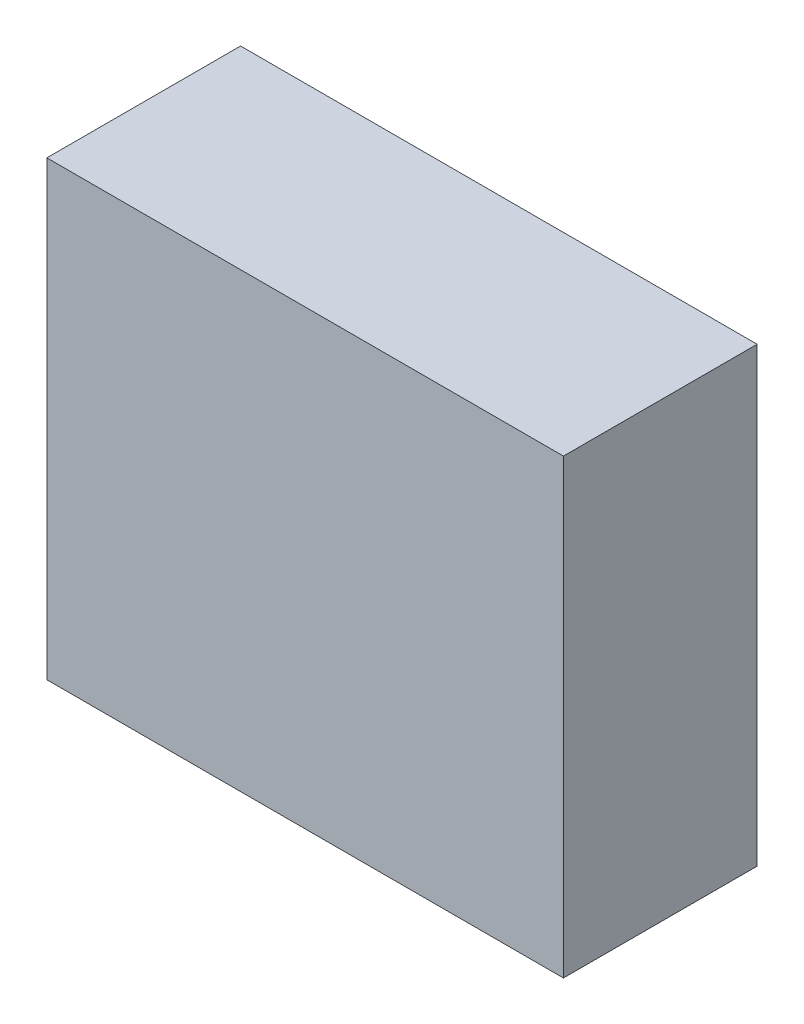
ISO-10303-21;
HEADER;
FILE_DESCRIPTION(('STEP AP214'),'2;1');
FILE_NAME('part.step','',(''),(''),'','','');
FILE_SCHEMA(('AUTOMOTIVE_DESIGN { 1 0 10303 214 1 1 1 1 }'));
ENDSEC;
DATA;
#1=APPLICATION_CONTEXT('core data for automotive mechanical design processes');
#2=APPLICATION_PROTOCOL_DEFINITION('international standard','automotive_design',2000,#1);
#3=PRODUCT_CONTEXT('',#1,'mechanical');
#4=PRODUCT('Part','Part','',(#3));
#5=PRODUCT_RELATED_PRODUCT_CATEGORY('part','',(#4));
#6=PRODUCT_DEFINITION_FORMATION('','',#4);
#7=PRODUCT_DEFINITION_CONTEXT('part definition',#1,'design');
#8=PRODUCT_DEFINITION('design','',#6,#7);
#9=PRODUCT_DEFINITION_SHAPE('','',#8);
#10=(LENGTH_UNIT() NAMED_UNIT(*) SI_UNIT(.MILLI.,.METRE.));
#11=(NAMED_UNIT(*) PLANE_ANGLE_UNIT() SI_UNIT($,.RADIAN.));
#12=(NAMED_UNIT(*) SI_UNIT($,.STERADIAN.) SOLID_ANGLE_UNIT());
#13=UNCERTAINTY_MEASURE_WITH_UNIT(LENGTH_MEASURE(1.E-05),#10,'distance_accuracy_value','');
#14=(GEOMETRIC_REPRESENTATION_CONTEXT(3) GLOBAL_UNCERTAINTY_ASSIGNED_CONTEXT((#13)) GLOBAL_UNIT_ASSIGNED_CONTEXT((#10,
#11,#12)) REPRESENTATION_CONTEXT('',''));
#15=CARTESIAN_POINT('',(0.,0.,0.));
#16=DIRECTION('',(0.,0.,1.));
#17=DIRECTION('',(1.,0.,0.));
#18=AXIS2_PLACEMENT_3D('',#15,#16,#17);
#19=CARTESIAN_POINT('',(50.8,44.45,-19.05));
#20=DIRECTION('',(1.,0.,0.));
#21=DIRECTION('',(0.,0.,-1.));
#22=AXIS2_PLACEMENT_3D('',#19,#20,#21);
#23=PLANE('',#22);
#24=DIRECTION('',(0.,0.,1.));
#25=VECTOR('',#24,1.);
#26=CARTESIAN_POINT('',(50.8,44.45,-19.05));
#27=LINE('',#26,#25);
#28=CARTESIAN_POINT('',(50.8,44.45,-19.05));
#29=VERTEX_POINT('',#28);
#30=CARTESIAN_POINT('',(50.8,44.45,19.05));
#31=VERTEX_POINT('',#30);
#32=EDGE_CURVE('E44',#29,#31,#27,.T.);
#33=ORIENTED_EDGE('',*,*,#32,.T.);
#34=DIRECTION('',(0.,1.,0.));
#35=VECTOR('',#34,1.);
#36=CARTESIAN_POINT('',(50.8,44.45,19.05));
#37=LINE('',#36,#35);
#38=CARTESIAN_POINT('',(50.8,-44.45,19.05));
#39=VERTEX_POINT('',#38);
#40=EDGE_CURVE('E82',#39,#31,#37,.T.);
#41=ORIENTED_EDGE('',*,*,#40,.F.);
#42=DIRECTION('',(0.,0.,1.));
#43=VECTOR('',#42,1.);
#44=CARTESIAN_POINT('',(50.8,-44.45,-19.05));
#45=LINE('',#44,#43);
#46=CARTESIAN_POINT('',(50.8,-44.45,-19.05));
#47=VERTEX_POINT('',#46);
#48=EDGE_CURVE('E11',#47,#39,#45,.T.);
#49=ORIENTED_EDGE('',*,*,#48,.F.);
#50=DIRECTION('',(0.,1.,0.));
#51=VECTOR('',#50,1.);
#52=CARTESIAN_POINT('',(50.8,44.45,-19.05));
#53=LINE('',#52,#51);
#54=EDGE_CURVE('E83',#47,#29,#53,.T.);
#55=ORIENTED_EDGE('',*,*,#54,.T.);
#56=EDGE_LOOP('',(#33,#41,#49,#55));
#57=FACE_BOUND('',#56,.T.);
#58=ADVANCED_FACE('F41',(#57),#23,.T.);
#59=CARTESIAN_POINT('',(-50.8,-44.45,-19.05));
#60=DIRECTION('',(0.,-1.,0.));
#61=DIRECTION('',(0.,0.,-1.));
#62=AXIS2_PLACEMENT_3D('',#59,#60,#61);
#63=PLANE('',#62);
#64=ORIENTED_EDGE('',*,*,#48,.T.);
#65=DIRECTION('',(1.,0.,0.));
#66=VECTOR('',#65,1.);
#67=CARTESIAN_POINT('',(-50.8,-44.45,19.05));
#68=LINE('',#67,#66);
#69=CARTESIAN_POINT('',(-50.8,-44.45,19.05));
#70=VERTEX_POINT('',#69);
#71=EDGE_CURVE('E101',#70,#39,#68,.T.);
#72=ORIENTED_EDGE('',*,*,#71,.F.);
#73=DIRECTION('',(0.,0.,1.));
#74=VECTOR('',#73,1.);
#75=CARTESIAN_POINT('',(-50.8,-44.45,-19.05));
#76=LINE('',#75,#74);
#77=CARTESIAN_POINT('',(-50.8,-44.45,-19.05));
#78=VERTEX_POINT('',#77);
#79=EDGE_CURVE('E50',#78,#70,#76,.T.);
#80=ORIENTED_EDGE('',*,*,#79,.F.);
#81=DIRECTION('',(1.,0.,0.));
#82=VECTOR('',#81,1.);
#83=CARTESIAN_POINT('',(-50.8,-44.45,-19.05));
#84=LINE('',#83,#82);
#85=EDGE_CURVE('E89',#78,#47,#84,.T.);
#86=ORIENTED_EDGE('',*,*,#85,.T.);
#87=EDGE_LOOP('',(#64,#72,#80,#86));
#88=FACE_BOUND('',#87,.T.);
#89=ADVANCED_FACE('F125',(#88),#63,.T.);
#90=CARTESIAN_POINT('',(-50.8,44.45,-19.05));
#91=DIRECTION('',(-1.,0.,0.));
#92=DIRECTION('',(0.,0.,1.));
#93=AXIS2_PLACEMENT_3D('',#90,#91,#92);
#94=PLANE('',#93);
#95=ORIENTED_EDGE('',*,*,#79,.T.);
#96=DIRECTION('',(0.,-1.,0.));
#97=VECTOR('',#96,1.);
#98=CARTESIAN_POINT('',(-50.8,44.45,19.05));
#99=LINE('',#98,#97);
#100=CARTESIAN_POINT('',(-50.8,44.45,19.05));
#101=VERTEX_POINT('',#100);
#102=EDGE_CURVE('E97',#101,#70,#99,.T.);
#103=ORIENTED_EDGE('',*,*,#102,.F.);
#104=DIRECTION('',(0.,0.,1.));
#105=VECTOR('',#104,1.);
#106=CARTESIAN_POINT('',(-50.8,44.45,-19.05));
#107=LINE('',#106,#105);
#108=CARTESIAN_POINT('',(-50.8,44.45,-19.05));
#109=VERTEX_POINT('',#108);
#110=EDGE_CURVE('E88',#109,#101,#107,.T.);
#111=ORIENTED_EDGE('',*,*,#110,.F.);
#112=DIRECTION('',(0.,-1.,0.));
#113=VECTOR('',#112,1.);
#114=CARTESIAN_POINT('',(-50.8,44.45,-19.05));
#115=LINE('',#114,#113);
#116=EDGE_CURVE('E114',#109,#78,#115,.T.);
#117=ORIENTED_EDGE('',*,*,#116,.T.);
#118=EDGE_LOOP('',(#95,#103,#111,#117));
#119=FACE_BOUND('',#118,.T.);
#120=ADVANCED_FACE('F122',(#119),#94,.T.);
#121=CARTESIAN_POINT('',(-50.8,44.45,-19.05));
#122=DIRECTION('',(0.,1.,0.));
#123=DIRECTION('',(0.,0.,1.));
#124=AXIS2_PLACEMENT_3D('',#121,#122,#123);
#125=PLANE('',#124);
#126=ORIENTED_EDGE('',*,*,#110,.T.);
#127=DIRECTION('',(-1.,0.,0.));
#128=VECTOR('',#127,1.);
#129=CARTESIAN_POINT('',(-50.8,44.45,19.05));
#130=LINE('',#129,#128);
#131=EDGE_CURVE('E91',#31,#101,#130,.T.);
#132=ORIENTED_EDGE('',*,*,#131,.F.);
#133=ORIENTED_EDGE('',*,*,#32,.F.);
#134=DIRECTION('',(-1.,0.,0.));
#135=VECTOR('',#134,1.);
#136=CARTESIAN_POINT('',(-50.8,44.45,-19.05));
#137=LINE('',#136,#135);
#138=EDGE_CURVE('E111',#29,#109,#137,.T.);
#139=ORIENTED_EDGE('',*,*,#138,.T.);
#140=EDGE_LOOP('',(#126,#132,#133,#139));
#141=FACE_BOUND('',#140,.T.);
#142=ADVANCED_FACE('F92',(#141),#125,.T.);
#143=CARTESIAN_POINT('',(0.,0.,-19.05));
#144=DIRECTION('',(0.,0.,1.));
#145=DIRECTION('',(1.,0.,0.));
#146=AXIS2_PLACEMENT_3D('',#143,#144,#145);
#147=PLANE('',#146);
#148=ORIENTED_EDGE('',*,*,#54,.F.);
#149=ORIENTED_EDGE('',*,*,#85,.F.);
#150=ORIENTED_EDGE('',*,*,#116,.F.);
#151=ORIENTED_EDGE('',*,*,#138,.F.);
#152=EDGE_LOOP('',(#148,#149,#150,#151));
#153=FACE_BOUND('',#152,.T.);
#154=ADVANCED_FACE('F127',(#153),#147,.F.);
#155=CARTESIAN_POINT('',(0.,0.,19.05));
#156=DIRECTION('',(0.,0.,1.));
#157=DIRECTION('',(1.,0.,0.));
#158=AXIS2_PLACEMENT_3D('',#155,#156,#157);
#159=PLANE('',#158);
#160=ORIENTED_EDGE('',*,*,#40,.T.);
#161=ORIENTED_EDGE('',*,*,#131,.T.);
#162=ORIENTED_EDGE('',*,*,#102,.T.);
#163=ORIENTED_EDGE('',*,*,#71,.T.);
#164=EDGE_LOOP('',(#160,#161,#162,#163));
#165=FACE_BOUND('',#164,.T.);
#166=ADVANCED_FACE('F100',(#165),#159,.T.);
#167=CLOSED_SHELL('',(#58,#89,#120,#142,#154,#166));
#168=MANIFOLD_SOLID_BREP('B2',#167);
#169=ADVANCED_BREP_SHAPE_REPRESENTATION('',(#18,#168),#14);
#170=SHAPE_DEFINITION_REPRESENTATION(#9,#169);
ENDSEC;
END-ISO-10303-21;
